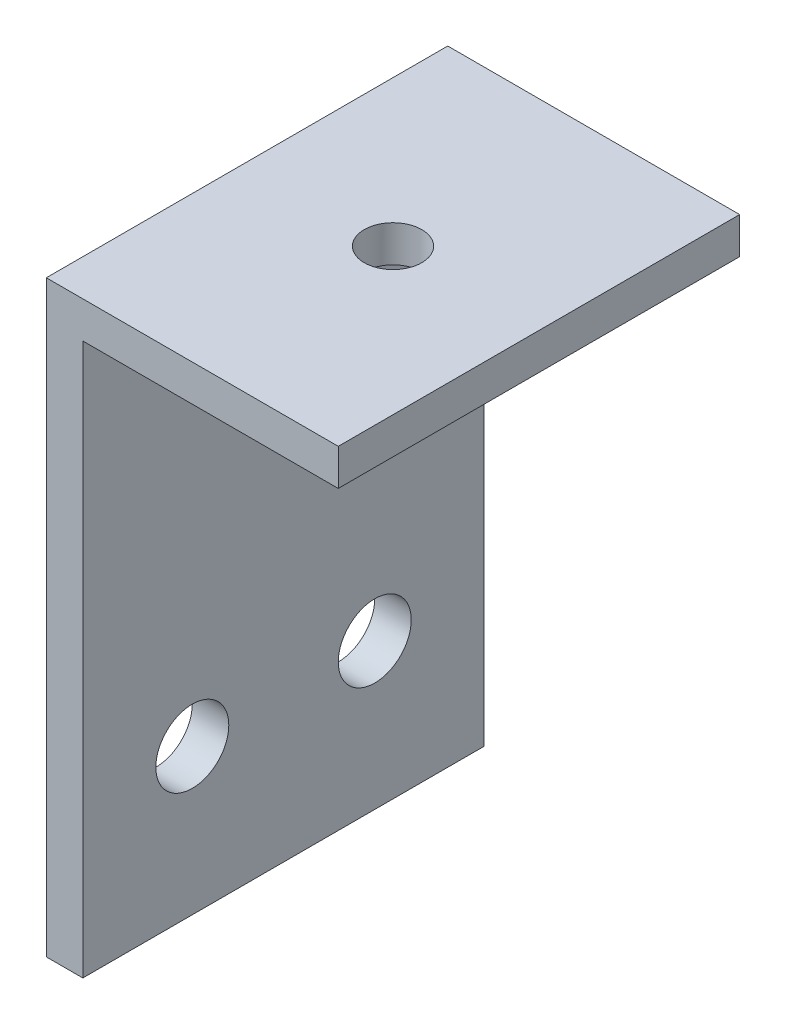
ISO-10303-21;
HEADER;
FILE_DESCRIPTION(('STEP AP214'),'2;1');
FILE_NAME('part.step','',(''),(''),'','','');
FILE_SCHEMA(('AUTOMOTIVE_DESIGN { 1 0 10303 214 1 1 1 1 }'));
ENDSEC;
DATA;
#1=APPLICATION_CONTEXT('core data for automotive mechanical design processes');
#2=APPLICATION_PROTOCOL_DEFINITION('international standard','automotive_design',2000,#1);
#3=PRODUCT_CONTEXT('',#1,'mechanical');
#4=PRODUCT('Part','Part','',(#3));
#5=PRODUCT_RELATED_PRODUCT_CATEGORY('part','',(#4));
#6=PRODUCT_DEFINITION_FORMATION('','',#4);
#7=PRODUCT_DEFINITION_CONTEXT('part definition',#1,'design');
#8=PRODUCT_DEFINITION('design','',#6,#7);
#9=PRODUCT_DEFINITION_SHAPE('','',#8);
#10=(LENGTH_UNIT() NAMED_UNIT(*) SI_UNIT(.MILLI.,.METRE.));
#11=(NAMED_UNIT(*) PLANE_ANGLE_UNIT() SI_UNIT($,.RADIAN.));
#12=(NAMED_UNIT(*) SI_UNIT($,.STERADIAN.) SOLID_ANGLE_UNIT());
#13=UNCERTAINTY_MEASURE_WITH_UNIT(LENGTH_MEASURE(1.E-05),#10,'distance_accuracy_value','');
#14=(GEOMETRIC_REPRESENTATION_CONTEXT(3) GLOBAL_UNCERTAINTY_ASSIGNED_CONTEXT((#13)) GLOBAL_UNIT_ASSIGNED_CONTEXT((#10,
#11,#12)) REPRESENTATION_CONTEXT('',''));
#15=CARTESIAN_POINT('',(0.,0.,0.));
#16=DIRECTION('',(0.,0.,1.));
#17=DIRECTION('',(1.,0.,0.));
#18=AXIS2_PLACEMENT_3D('',#15,#16,#17);
#19=CARTESIAN_POINT('',(0.,0.,34.925));
#20=DIRECTION('',(1.,0.,0.));
#21=DIRECTION('',(0.,0.,-1.));
#22=AXIS2_PLACEMENT_3D('',#19,#20,#21);
#23=PLANE('',#22);
#24=CARTESIAN_POINT('',(0.,12.7,9.525));
#25=DIRECTION('',(1.,0.,0.));
#26=DIRECTION('',(0.,0.,-1.));
#27=AXIS2_PLACEMENT_3D('',#24,#25,#26);
#28=CIRCLE('',#27,3.175);
#29=CARTESIAN_POINT('',(0.,12.7,6.35));
#30=VERTEX_POINT('',#29);
#31=EDGE_CURVE('E161',#30,#30,#28,.T.);
#32=ORIENTED_EDGE('',*,*,#31,.T.);
#33=EDGE_LOOP('',(#32));
#34=FACE_BOUND('',#33,.T.);
#35=CARTESIAN_POINT('',(0.,12.7,25.4));
#36=DIRECTION('',(1.,0.,0.));
#37=DIRECTION('',(0.,0.,-1.));
#38=AXIS2_PLACEMENT_3D('',#35,#36,#37);
#39=CIRCLE('',#38,3.175);
#40=CARTESIAN_POINT('',(0.,12.7,22.225));
#41=VERTEX_POINT('',#40);
#42=EDGE_CURVE('E120',#41,#41,#39,.T.);
#43=ORIENTED_EDGE('',*,*,#42,.T.);
#44=EDGE_LOOP('',(#43));
#45=FACE_BOUND('',#44,.T.);
#46=DIRECTION('',(0.,-1.,0.));
#47=VECTOR('',#46,1.);
#48=CARTESIAN_POINT('',(0.,0.,0.));
#49=LINE('',#48,#47);
#50=CARTESIAN_POINT('',(0.,51.175,0.));
#51=VERTEX_POINT('',#50);
#52=CARTESIAN_POINT('',(0.,0.,0.));
#53=VERTEX_POINT('',#52);
#54=EDGE_CURVE('E116',#51,#53,#49,.T.);
#55=ORIENTED_EDGE('',*,*,#54,.T.);
#56=DIRECTION('',(0.,0.,-1.));
#57=VECTOR('',#56,1.);
#58=CARTESIAN_POINT('',(0.,0.,34.925));
#59=LINE('',#58,#57);
#60=CARTESIAN_POINT('',(0.,0.,34.925));
#61=VERTEX_POINT('',#60);
#62=EDGE_CURVE('E11',#61,#53,#59,.T.);
#63=ORIENTED_EDGE('',*,*,#62,.F.);
#64=DIRECTION('',(0.,-1.,0.));
#65=VECTOR('',#64,1.);
#66=CARTESIAN_POINT('',(0.,0.,34.925));
#67=LINE('',#66,#65);
#68=CARTESIAN_POINT('',(0.,51.175,34.925));
#69=VERTEX_POINT('',#68);
#70=EDGE_CURVE('E127',#69,#61,#67,.T.);
#71=ORIENTED_EDGE('',*,*,#70,.F.);
#72=DIRECTION('',(0.,0.,-1.));
#73=VECTOR('',#72,1.);
#74=CARTESIAN_POINT('',(0.,51.175,34.925));
#75=LINE('',#74,#73);
#76=EDGE_CURVE('E112',#69,#51,#75,.T.);
#77=ORIENTED_EDGE('',*,*,#76,.T.);
#78=EDGE_LOOP('',(#55,#63,#71,#77));
#79=FACE_BOUND('',#78,.T.);
#80=ADVANCED_FACE('F32',(#34,#45,#79),#23,.F.);
#81=CARTESIAN_POINT('',(0.,0.,34.925));
#82=DIRECTION('',(0.,1.,0.));
#83=DIRECTION('',(-1.,0.,0.));
#84=AXIS2_PLACEMENT_3D('',#81,#82,#83);
#85=PLANE('',#84);
#86=DIRECTION('',(1.,0.,0.));
#87=VECTOR('',#86,1.);
#88=CARTESIAN_POINT('',(0.,0.,0.));
#89=LINE('',#88,#87);
#90=CARTESIAN_POINT('',(3.175,0.,0.));
#91=VERTEX_POINT('',#90);
#92=EDGE_CURVE('E119',#53,#91,#89,.T.);
#93=ORIENTED_EDGE('',*,*,#92,.T.);
#94=DIRECTION('',(0.,0.,-1.));
#95=VECTOR('',#94,1.);
#96=CARTESIAN_POINT('',(3.175,0.,34.925));
#97=LINE('',#96,#95);
#98=CARTESIAN_POINT('',(3.175,0.,34.925));
#99=VERTEX_POINT('',#98);
#100=EDGE_CURVE('E40',#99,#91,#97,.T.);
#101=ORIENTED_EDGE('',*,*,#100,.F.);
#102=DIRECTION('',(1.,0.,0.));
#103=VECTOR('',#102,1.);
#104=CARTESIAN_POINT('',(0.,0.,34.925));
#105=LINE('',#104,#103);
#106=EDGE_CURVE('E85',#61,#99,#105,.T.);
#107=ORIENTED_EDGE('',*,*,#106,.F.);
#108=ORIENTED_EDGE('',*,*,#62,.T.);
#109=EDGE_LOOP('',(#93,#101,#107,#108));
#110=FACE_BOUND('',#109,.T.);
#111=ADVANCED_FACE('F153',(#110),#85,.F.);
#112=CARTESIAN_POINT('',(3.175,0.,34.925));
#113=DIRECTION('',(-1.,0.,0.));
#114=DIRECTION('',(0.,0.,1.));
#115=AXIS2_PLACEMENT_3D('',#112,#113,#114);
#116=PLANE('',#115);
#117=CARTESIAN_POINT('',(3.175,12.7,9.525));
#118=DIRECTION('',(1.,0.,0.));
#119=DIRECTION('',(0.,0.,-1.));
#120=AXIS2_PLACEMENT_3D('',#117,#118,#119);
#121=CIRCLE('',#120,3.175);
#122=CARTESIAN_POINT('',(3.175,12.7,6.35));
#123=VERTEX_POINT('',#122);
#124=EDGE_CURVE('E170',#123,#123,#121,.T.);
#125=ORIENTED_EDGE('',*,*,#124,.F.);
#126=EDGE_LOOP('',(#125));
#127=FACE_BOUND('',#126,.T.);
#128=CARTESIAN_POINT('',(3.175,12.7,25.4));
#129=DIRECTION('',(1.,0.,0.));
#130=DIRECTION('',(0.,0.,-1.));
#131=AXIS2_PLACEMENT_3D('',#128,#129,#130);
#132=CIRCLE('',#131,3.175);
#133=CARTESIAN_POINT('',(3.175,12.7,22.225));
#134=VERTEX_POINT('',#133);
#135=EDGE_CURVE('E165',#134,#134,#132,.T.);
#136=ORIENTED_EDGE('',*,*,#135,.F.);
#137=EDGE_LOOP('',(#136));
#138=FACE_BOUND('',#137,.T.);
#139=DIRECTION('',(0.,1.,0.));
#140=VECTOR('',#139,1.);
#141=CARTESIAN_POINT('',(3.175,0.,0.));
#142=LINE('',#141,#140);
#143=CARTESIAN_POINT('',(3.175,48.,0.));
#144=VERTEX_POINT('',#143);
#145=EDGE_CURVE('E122',#91,#144,#142,.T.);
#146=ORIENTED_EDGE('',*,*,#145,.T.);
#147=DIRECTION('',(0.,0.,-1.));
#148=VECTOR('',#147,1.);
#149=CARTESIAN_POINT('',(3.175,48.,34.925));
#150=LINE('',#149,#148);
#151=CARTESIAN_POINT('',(3.175,48.,34.925));
#152=VERTEX_POINT('',#151);
#153=EDGE_CURVE('E107',#152,#144,#150,.T.);
#154=ORIENTED_EDGE('',*,*,#153,.F.);
#155=DIRECTION('',(0.,1.,0.));
#156=VECTOR('',#155,1.);
#157=CARTESIAN_POINT('',(3.175,0.,34.925));
#158=LINE('',#157,#156);
#159=EDGE_CURVE('E98',#99,#152,#158,.T.);
#160=ORIENTED_EDGE('',*,*,#159,.F.);
#161=ORIENTED_EDGE('',*,*,#100,.T.);
#162=EDGE_LOOP('',(#146,#154,#160,#161));
#163=FACE_BOUND('',#162,.T.);
#164=ADVANCED_FACE('F133',(#127,#138,#163),#116,.F.);
#165=CARTESIAN_POINT('',(25.4,48.,34.925));
#166=DIRECTION('',(0.,1.,0.));
#167=DIRECTION('',(-1.,0.,0.));
#168=AXIS2_PLACEMENT_3D('',#165,#166,#167);
#169=PLANE('',#168);
#170=CARTESIAN_POINT('',(12.7,48.,17.4625));
#171=DIRECTION('',(0.,1.,0.));
#172=DIRECTION('',(-1.,0.,0.));
#173=AXIS2_PLACEMENT_3D('',#170,#171,#172);
#174=CIRCLE('',#173,2.5);
#175=CARTESIAN_POINT('',(10.2,48.,17.4625));
#176=VERTEX_POINT('',#175);
#177=EDGE_CURVE('E175',#176,#176,#174,.T.);
#178=ORIENTED_EDGE('',*,*,#177,.T.);
#179=EDGE_LOOP('',(#178));
#180=FACE_BOUND('',#179,.T.);
#181=DIRECTION('',(1.,0.,0.));
#182=VECTOR('',#181,1.);
#183=CARTESIAN_POINT('',(25.4,48.,0.));
#184=LINE('',#183,#182);
#185=CARTESIAN_POINT('',(25.4,48.,0.));
#186=VERTEX_POINT('',#185);
#187=EDGE_CURVE('E106',#144,#186,#184,.T.);
#188=ORIENTED_EDGE('',*,*,#187,.T.);
#189=DIRECTION('',(0.,0.,-1.));
#190=VECTOR('',#189,1.);
#191=CARTESIAN_POINT('',(25.4,48.,34.925));
#192=LINE('',#191,#190);
#193=CARTESIAN_POINT('',(25.4,48.,34.925));
#194=VERTEX_POINT('',#193);
#195=EDGE_CURVE('E103',#194,#186,#192,.T.);
#196=ORIENTED_EDGE('',*,*,#195,.F.);
#197=DIRECTION('',(1.,0.,0.));
#198=VECTOR('',#197,1.);
#199=CARTESIAN_POINT('',(25.4,48.,34.925));
#200=LINE('',#199,#198);
#201=EDGE_CURVE('E92',#152,#194,#200,.T.);
#202=ORIENTED_EDGE('',*,*,#201,.F.);
#203=ORIENTED_EDGE('',*,*,#153,.T.);
#204=EDGE_LOOP('',(#188,#196,#202,#203));
#205=FACE_BOUND('',#204,.T.);
#206=ADVANCED_FACE('F104',(#180,#205),#169,.F.);
#207=CARTESIAN_POINT('',(25.4,48.,34.925));
#208=DIRECTION('',(-1.,0.,0.));
#209=DIRECTION('',(0.,0.,1.));
#210=AXIS2_PLACEMENT_3D('',#207,#208,#209);
#211=PLANE('',#210);
#212=DIRECTION('',(0.,1.,0.));
#213=VECTOR('',#212,1.);
#214=CARTESIAN_POINT('',(25.4,48.,0.));
#215=LINE('',#214,#213);
#216=CARTESIAN_POINT('',(25.4,51.175,0.));
#217=VERTEX_POINT('',#216);
#218=EDGE_CURVE('E71',#186,#217,#215,.T.);
#219=ORIENTED_EDGE('',*,*,#218,.T.);
#220=DIRECTION('',(0.,0.,-1.));
#221=VECTOR('',#220,1.);
#222=CARTESIAN_POINT('',(25.4,51.175,34.925));
#223=LINE('',#222,#221);
#224=CARTESIAN_POINT('',(25.4,51.175,34.925));
#225=VERTEX_POINT('',#224);
#226=EDGE_CURVE('E108',#225,#217,#223,.T.);
#227=ORIENTED_EDGE('',*,*,#226,.F.);
#228=DIRECTION('',(0.,1.,0.));
#229=VECTOR('',#228,1.);
#230=CARTESIAN_POINT('',(25.4,48.,34.925));
#231=LINE('',#230,#229);
#232=EDGE_CURVE('E96',#194,#225,#231,.T.);
#233=ORIENTED_EDGE('',*,*,#232,.F.);
#234=ORIENTED_EDGE('',*,*,#195,.T.);
#235=EDGE_LOOP('',(#219,#227,#233,#234));
#236=FACE_BOUND('',#235,.T.);
#237=ADVANCED_FACE('F110',(#236),#211,.F.);
#238=CARTESIAN_POINT('',(0.,51.175,34.925));
#239=DIRECTION('',(0.,-1.,0.));
#240=DIRECTION('',(0.,0.,-1.));
#241=AXIS2_PLACEMENT_3D('',#238,#239,#240);
#242=PLANE('',#241);
#243=CARTESIAN_POINT('',(12.7,51.175,17.4625));
#244=DIRECTION('',(0.,1.,0.));
#245=DIRECTION('',(0.,0.,1.));
#246=AXIS2_PLACEMENT_3D('',#243,#244,#245);
#247=CIRCLE('',#246,2.5);
#248=CARTESIAN_POINT('',(12.7,51.175,19.9625));
#249=VERTEX_POINT('',#248);
#250=EDGE_CURVE('E179',#249,#249,#247,.T.);
#251=ORIENTED_EDGE('',*,*,#250,.F.);
#252=EDGE_LOOP('',(#251));
#253=FACE_BOUND('',#252,.T.);
#254=DIRECTION('',(-1.,0.,0.));
#255=VECTOR('',#254,1.);
#256=CARTESIAN_POINT('',(0.,51.175,0.));
#257=LINE('',#256,#255);
#258=EDGE_CURVE('E77',#217,#51,#257,.T.);
#259=ORIENTED_EDGE('',*,*,#258,.T.);
#260=ORIENTED_EDGE('',*,*,#76,.F.);
#261=DIRECTION('',(-1.,0.,0.));
#262=VECTOR('',#261,1.);
#263=CARTESIAN_POINT('',(0.,51.175,34.925));
#264=LINE('',#263,#262);
#265=EDGE_CURVE('E48',#225,#69,#264,.T.);
#266=ORIENTED_EDGE('',*,*,#265,.F.);
#267=ORIENTED_EDGE('',*,*,#226,.T.);
#268=EDGE_LOOP('',(#259,#260,#266,#267));
#269=FACE_BOUND('',#268,.T.);
#270=ADVANCED_FACE('F140',(#253,#269),#242,.F.);
#271=CARTESIAN_POINT('',(0.,0.,34.925));
#272=DIRECTION('',(0.,0.,-1.));
#273=DIRECTION('',(-1.,0.,0.));
#274=AXIS2_PLACEMENT_3D('',#271,#272,#273);
#275=PLANE('',#274);
#276=ORIENTED_EDGE('',*,*,#70,.T.);
#277=ORIENTED_EDGE('',*,*,#106,.T.);
#278=ORIENTED_EDGE('',*,*,#159,.T.);
#279=ORIENTED_EDGE('',*,*,#201,.T.);
#280=ORIENTED_EDGE('',*,*,#232,.T.);
#281=ORIENTED_EDGE('',*,*,#265,.T.);
#282=EDGE_LOOP('',(#276,#277,#278,#279,#280,#281));
#283=FACE_BOUND('',#282,.T.);
#284=ADVANCED_FACE('F94',(#283),#275,.F.);
#285=CARTESIAN_POINT('',(0.,0.,0.));
#286=DIRECTION('',(0.,0.,-1.));
#287=DIRECTION('',(-1.,0.,0.));
#288=AXIS2_PLACEMENT_3D('',#285,#286,#287);
#289=PLANE('',#288);
#290=ORIENTED_EDGE('',*,*,#54,.F.);
#291=ORIENTED_EDGE('',*,*,#258,.F.);
#292=ORIENTED_EDGE('',*,*,#218,.F.);
#293=ORIENTED_EDGE('',*,*,#187,.F.);
#294=ORIENTED_EDGE('',*,*,#145,.F.);
#295=ORIENTED_EDGE('',*,*,#92,.F.);
#296=EDGE_LOOP('',(#290,#291,#292,#293,#294,#295));
#297=FACE_BOUND('',#296,.T.);
#298=ADVANCED_FACE('F136',(#297),#289,.T.);
#299=CARTESIAN_POINT('',(0.,12.7,25.4));
#300=DIRECTION('',(1.,0.,0.));
#301=DIRECTION('',(0.,0.,-1.));
#302=AXIS2_PLACEMENT_3D('',#299,#300,#301);
#303=CYLINDRICAL_SURFACE('',#302,3.175);
#304=ORIENTED_EDGE('',*,*,#42,.F.);
#305=EDGE_LOOP('',(#304));
#306=FACE_BOUND('',#305,.T.);
#307=ORIENTED_EDGE('',*,*,#135,.T.);
#308=EDGE_LOOP('',(#307));
#309=FACE_BOUND('',#308,.T.);
#310=ADVANCED_FACE('F202',(#306,#309),#303,.F.);
#311=CARTESIAN_POINT('',(0.,12.7,9.525));
#312=DIRECTION('',(1.,0.,0.));
#313=DIRECTION('',(0.,0.,-1.));
#314=AXIS2_PLACEMENT_3D('',#311,#312,#313);
#315=CYLINDRICAL_SURFACE('',#314,3.175);
#316=ORIENTED_EDGE('',*,*,#31,.F.);
#317=EDGE_LOOP('',(#316));
#318=FACE_BOUND('',#317,.T.);
#319=ORIENTED_EDGE('',*,*,#124,.T.);
#320=EDGE_LOOP('',(#319));
#321=FACE_BOUND('',#320,.T.);
#322=ADVANCED_FACE('F185',(#318,#321),#315,.F.);
#323=CARTESIAN_POINT('',(12.7,0.,17.4625));
#324=DIRECTION('',(0.,1.,0.));
#325=DIRECTION('',(0.,0.,1.));
#326=AXIS2_PLACEMENT_3D('',#323,#324,#325);
#327=CYLINDRICAL_SURFACE('',#326,2.5);
#328=ORIENTED_EDGE('',*,*,#250,.T.);
#329=EDGE_LOOP('',(#328));
#330=FACE_BOUND('',#329,.T.);
#331=ORIENTED_EDGE('',*,*,#177,.F.);
#332=EDGE_LOOP('',(#331));
#333=FACE_BOUND('',#332,.T.);
#334=ADVANCED_FACE('F182',(#330,#333),#327,.F.);
#335=CLOSED_SHELL('',(#80,#111,#164,#206,#237,#270,#284,#298,#310,#322,#334));
#336=MANIFOLD_SOLID_BREP('B2',#335);
#337=ADVANCED_BREP_SHAPE_REPRESENTATION('',(#18,#336),#14);
#338=SHAPE_DEFINITION_REPRESENTATION(#9,#337);
ENDSEC;
END-ISO-10303-21;
